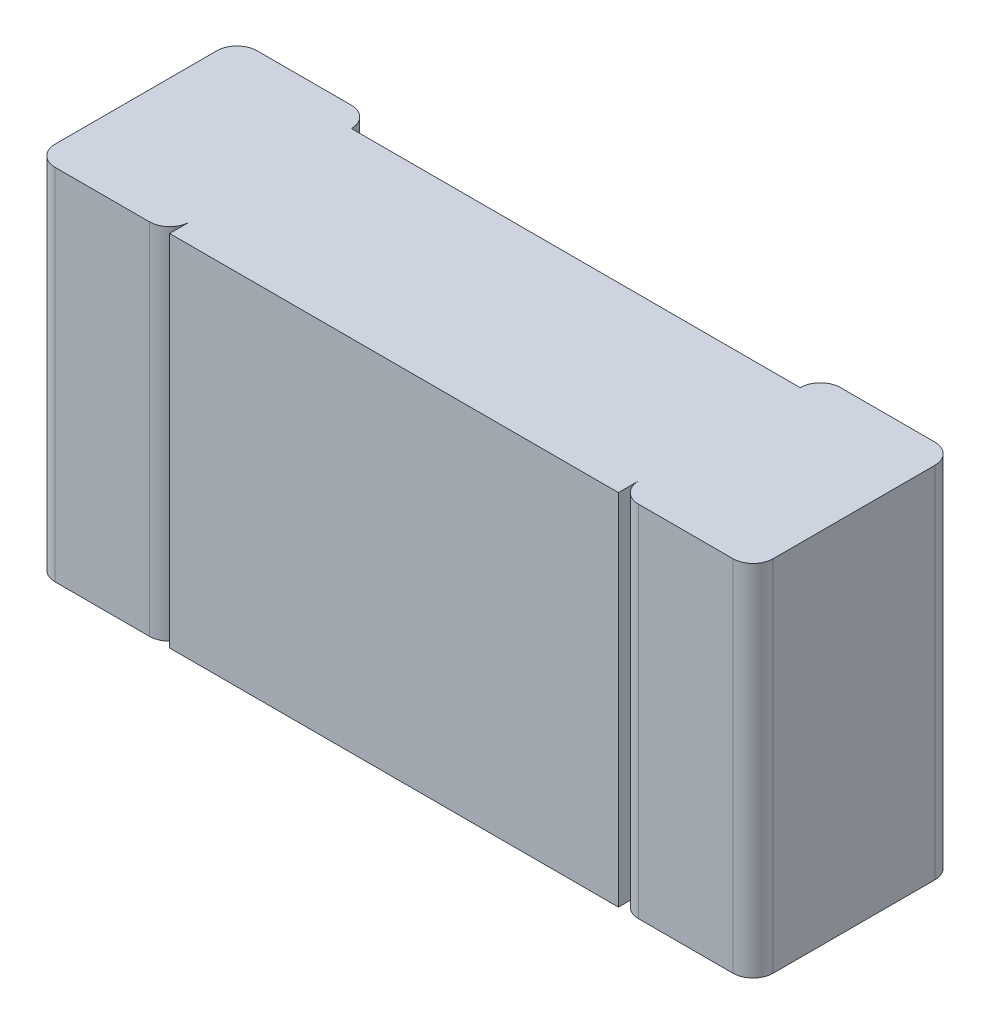
ISO-10303-21;
HEADER;
FILE_DESCRIPTION(('STEP AP214'),'2;1');
FILE_NAME('part.step','',(''),(''),'','','');
FILE_SCHEMA(('AUTOMOTIVE_DESIGN { 1 0 10303 214 1 1 1 1 }'));
ENDSEC;
DATA;
#1=APPLICATION_CONTEXT('core data for automotive mechanical design processes');
#2=APPLICATION_PROTOCOL_DEFINITION('international standard','automotive_design',2000,#1);
#3=PRODUCT_CONTEXT('',#1,'mechanical');
#4=PRODUCT('Part','Part','',(#3));
#5=PRODUCT_RELATED_PRODUCT_CATEGORY('part','',(#4));
#6=PRODUCT_DEFINITION_FORMATION('','',#4);
#7=PRODUCT_DEFINITION_CONTEXT('part definition',#1,'design');
#8=PRODUCT_DEFINITION('design','',#6,#7);
#9=PRODUCT_DEFINITION_SHAPE('','',#8);
#10=(LENGTH_UNIT() NAMED_UNIT(*) SI_UNIT(.MILLI.,.METRE.));
#11=(NAMED_UNIT(*) PLANE_ANGLE_UNIT() SI_UNIT($,.RADIAN.));
#12=(NAMED_UNIT(*) SI_UNIT($,.STERADIAN.) SOLID_ANGLE_UNIT());
#13=UNCERTAINTY_MEASURE_WITH_UNIT(LENGTH_MEASURE(1.E-05),#10,'distance_accuracy_value','');
#14=(GEOMETRIC_REPRESENTATION_CONTEXT(3) GLOBAL_UNCERTAINTY_ASSIGNED_CONTEXT((#13)) GLOBAL_UNIT_ASSIGNED_CONTEXT((#10,
#11,#12)) REPRESENTATION_CONTEXT('',''));
#15=CARTESIAN_POINT('',(0.,0.,0.));
#16=DIRECTION('',(0.,0.,1.));
#17=DIRECTION('',(1.,0.,0.));
#18=AXIS2_PLACEMENT_3D('',#15,#16,#17);
#19=CARTESIAN_POINT('',(-0.5,-0.4,0.45));
#20=DIRECTION('',(0.,0.,1.));
#21=DIRECTION('',(1.,0.,0.));
#22=AXIS2_PLACEMENT_3D('',#19,#20,#21);
#23=PLANE('',#22);
#24=DIRECTION('',(0.,1.,0.));
#25=VECTOR('',#24,1.);
#26=CARTESIAN_POINT('',(-0.5,-0.4,0.45));
#27=LINE('',#26,#25);
#28=CARTESIAN_POINT('',(-0.5,-0.4,0.45));
#29=VERTEX_POINT('',#28);
#30=CARTESIAN_POINT('',(-0.5,0.4,0.45));
#31=VERTEX_POINT('',#30);
#32=EDGE_CURVE('E309',#29,#31,#27,.T.);
#33=ORIENTED_EDGE('',*,*,#32,.F.);
#34=DIRECTION('',(1.,0.,0.));
#35=VECTOR('',#34,1.);
#36=CARTESIAN_POINT('',(-0.5,-0.4,0.45));
#37=LINE('',#36,#35);
#38=CARTESIAN_POINT('',(0.5,-0.4,0.45));
#39=VERTEX_POINT('',#38);
#40=EDGE_CURVE('E302',#29,#39,#37,.T.);
#41=ORIENTED_EDGE('',*,*,#40,.T.);
#42=DIRECTION('',(0.,1.,0.));
#43=VECTOR('',#42,1.);
#44=CARTESIAN_POINT('',(0.5,-0.4,0.45));
#45=LINE('',#44,#43);
#46=CARTESIAN_POINT('',(0.5,0.4,0.45));
#47=VERTEX_POINT('',#46);
#48=EDGE_CURVE('E11',#39,#47,#45,.T.);
#49=ORIENTED_EDGE('',*,*,#48,.T.);
#50=DIRECTION('',(1.,0.,0.));
#51=VECTOR('',#50,1.);
#52=CARTESIAN_POINT('',(-0.5,0.4,0.45));
#53=LINE('',#52,#51);
#54=EDGE_CURVE('E338',#31,#47,#53,.T.);
#55=ORIENTED_EDGE('',*,*,#54,.F.);
#56=EDGE_LOOP('',(#33,#41,#49,#55));
#57=FACE_BOUND('',#56,.T.);
#58=ADVANCED_FACE('F17',(#57),#23,.T.);
#59=CARTESIAN_POINT('',(0.5,-0.4,0.405));
#60=DIRECTION('',(1.,0.,0.));
#61=DIRECTION('',(0.,1.,0.));
#62=AXIS2_PLACEMENT_3D('',#59,#60,#61);
#63=PLANE('',#62);
#64=DIRECTION('',(0.,0.,1.));
#65=VECTOR('',#64,1.);
#66=CARTESIAN_POINT('',(0.5,-0.4,0.405));
#67=LINE('',#66,#65);
#68=CARTESIAN_POINT('',(0.5,-0.4,0.405));
#69=VERTEX_POINT('',#68);
#70=EDGE_CURVE('E298',#69,#39,#67,.T.);
#71=ORIENTED_EDGE('',*,*,#70,.F.);
#72=DIRECTION('',(0.,1.,0.));
#73=VECTOR('',#72,1.);
#74=CARTESIAN_POINT('',(0.5,-0.4,0.405));
#75=LINE('',#74,#73);
#76=CARTESIAN_POINT('',(0.5,0.4,0.405));
#77=VERTEX_POINT('',#76);
#78=EDGE_CURVE('E27',#69,#77,#75,.T.);
#79=ORIENTED_EDGE('',*,*,#78,.T.);
#80=DIRECTION('',(0.,0.,1.));
#81=VECTOR('',#80,1.);
#82=CARTESIAN_POINT('',(0.5,0.4,0.405));
#83=LINE('',#82,#81);
#84=EDGE_CURVE('E344',#77,#47,#83,.T.);
#85=ORIENTED_EDGE('',*,*,#84,.T.);
#86=ORIENTED_EDGE('',*,*,#48,.F.);
#87=EDGE_LOOP('',(#71,#79,#85,#86));
#88=FACE_BOUND('',#87,.T.);
#89=ADVANCED_FACE('F449',(#88),#63,.T.);
#90=CARTESIAN_POINT('',(0.545,-0.4,0.405));
#91=DIRECTION('',(0.,1.,0.));
#92=DIRECTION('',(-1.,0.,0.));
#93=AXIS2_PLACEMENT_3D('',#90,#91,#92);
#94=CYLINDRICAL_SURFACE('',#93,0.045);
#95=CARTESIAN_POINT('',(0.545,-0.4,0.405));
#96=DIRECTION('',(0.,1.,0.));
#97=DIRECTION('',(0.,0.,1.));
#98=AXIS2_PLACEMENT_3D('',#95,#96,#97);
#99=CIRCLE('',#98,0.045);
#100=CARTESIAN_POINT('',(0.545,-0.4,0.45));
#101=VERTEX_POINT('',#100);
#102=EDGE_CURVE('E289',#69,#101,#99,.T.);
#103=ORIENTED_EDGE('',*,*,#102,.T.);
#104=DIRECTION('',(0.,1.,0.));
#105=VECTOR('',#104,1.);
#106=CARTESIAN_POINT('',(0.545,-0.4,0.45));
#107=LINE('',#106,#105);
#108=CARTESIAN_POINT('',(0.545,0.4,0.45));
#109=VERTEX_POINT('',#108);
#110=EDGE_CURVE('E252',#101,#109,#107,.T.);
#111=ORIENTED_EDGE('',*,*,#110,.T.);
#112=CARTESIAN_POINT('',(0.545,0.4,0.405));
#113=DIRECTION('',(0.,1.,0.));
#114=DIRECTION('',(0.,0.,1.));
#115=AXIS2_PLACEMENT_3D('',#112,#113,#114);
#116=CIRCLE('',#115,0.045);
#117=EDGE_CURVE('E319',#77,#109,#116,.T.);
#118=ORIENTED_EDGE('',*,*,#117,.F.);
#119=ORIENTED_EDGE('',*,*,#78,.F.);
#120=EDGE_LOOP('',(#103,#111,#118,#119));
#121=FACE_BOUND('',#120,.T.);
#122=ADVANCED_FACE('F19',(#121),#94,.T.);
#123=CARTESIAN_POINT('',(0.5,-0.4,0.45));
#124=DIRECTION('',(0.,0.,1.));
#125=DIRECTION('',(1.,0.,0.));
#126=AXIS2_PLACEMENT_3D('',#123,#124,#125);
#127=PLANE('',#126);
#128=DIRECTION('',(1.,0.,0.));
#129=VECTOR('',#128,1.);
#130=CARTESIAN_POINT('',(0.5,0.4,0.45));
#131=LINE('',#130,#129);
#132=CARTESIAN_POINT('',(0.755,0.4,0.45));
#133=VERTEX_POINT('',#132);
#134=EDGE_CURVE('E323',#109,#133,#131,.T.);
#135=ORIENTED_EDGE('',*,*,#134,.F.);
#136=ORIENTED_EDGE('',*,*,#110,.F.);
#137=DIRECTION('',(1.,0.,0.));
#138=VECTOR('',#137,1.);
#139=CARTESIAN_POINT('',(0.5,-0.4,0.45));
#140=LINE('',#139,#138);
#141=CARTESIAN_POINT('',(0.755,-0.4,0.45));
#142=VERTEX_POINT('',#141);
#143=EDGE_CURVE('E279',#101,#142,#140,.T.);
#144=ORIENTED_EDGE('',*,*,#143,.T.);
#145=DIRECTION('',(0.,1.,0.));
#146=VECTOR('',#145,1.);
#147=CARTESIAN_POINT('',(0.755,-0.4,0.45));
#148=LINE('',#147,#146);
#149=EDGE_CURVE('E249',#142,#133,#148,.T.);
#150=ORIENTED_EDGE('',*,*,#149,.T.);
#151=EDGE_LOOP('',(#135,#136,#144,#150));
#152=FACE_BOUND('',#151,.T.);
#153=ADVANCED_FACE('F372',(#152),#127,.T.);
#154=CARTESIAN_POINT('',(0.755,-0.4,0.405));
#155=DIRECTION('',(0.,1.,0.));
#156=DIRECTION('',(1.,0.,0.));
#157=AXIS2_PLACEMENT_3D('',#154,#155,#156);
#158=CYLINDRICAL_SURFACE('',#157,0.045);
#159=DIRECTION('',(0.,1.,0.));
#160=VECTOR('',#159,1.);
#161=CARTESIAN_POINT('',(0.8,-0.4,0.405));
#162=LINE('',#161,#160);
#163=CARTESIAN_POINT('',(0.8,-0.4,0.405));
#164=VERTEX_POINT('',#163);
#165=CARTESIAN_POINT('',(0.8,0.4,0.405));
#166=VERTEX_POINT('',#165);
#167=EDGE_CURVE('E21',#164,#166,#162,.T.);
#168=ORIENTED_EDGE('',*,*,#167,.T.);
#169=CARTESIAN_POINT('',(0.755,0.4,0.405));
#170=DIRECTION('',(0.,-1.,0.));
#171=DIRECTION('',(0.,0.,1.));
#172=AXIS2_PLACEMENT_3D('',#169,#170,#171);
#173=CIRCLE('',#172,0.045);
#174=EDGE_CURVE('E327',#166,#133,#173,.T.);
#175=ORIENTED_EDGE('',*,*,#174,.T.);
#176=ORIENTED_EDGE('',*,*,#149,.F.);
#177=CARTESIAN_POINT('',(0.755,-0.4,0.405));
#178=DIRECTION('',(0.,-1.,0.));
#179=DIRECTION('',(0.,0.,1.));
#180=AXIS2_PLACEMENT_3D('',#177,#178,#179);
#181=CIRCLE('',#180,0.045);
#182=EDGE_CURVE('E275',#164,#142,#181,.T.);
#183=ORIENTED_EDGE('',*,*,#182,.F.);
#184=EDGE_LOOP('',(#168,#175,#176,#183));
#185=FACE_BOUND('',#184,.T.);
#186=ADVANCED_FACE('F361',(#185),#158,.T.);
#187=CARTESIAN_POINT('',(0.8,-0.4,0.));
#188=DIRECTION('',(1.,0.,0.));
#189=DIRECTION('',(0.,1.,0.));
#190=AXIS2_PLACEMENT_3D('',#187,#188,#189);
#191=PLANE('',#190);
#192=DIRECTION('',(0.,0.,1.));
#193=VECTOR('',#192,1.);
#194=CARTESIAN_POINT('',(0.8,-0.4,0.));
#195=LINE('',#194,#193);
#196=CARTESIAN_POINT('',(0.8,-0.4,0.045));
#197=VERTEX_POINT('',#196);
#198=EDGE_CURVE('E271',#197,#164,#195,.T.);
#199=ORIENTED_EDGE('',*,*,#198,.F.);
#200=DIRECTION('',(0.,1.,0.));
#201=VECTOR('',#200,1.);
#202=CARTESIAN_POINT('',(0.8,-0.4,0.045));
#203=LINE('',#202,#201);
#204=CARTESIAN_POINT('',(0.8,0.4,0.045));
#205=VERTEX_POINT('',#204);
#206=EDGE_CURVE('E48',#197,#205,#203,.T.);
#207=ORIENTED_EDGE('',*,*,#206,.T.);
#208=DIRECTION('',(0.,0.,1.));
#209=VECTOR('',#208,1.);
#210=CARTESIAN_POINT('',(0.8,0.4,0.));
#211=LINE('',#210,#209);
#212=EDGE_CURVE('E331',#205,#166,#211,.T.);
#213=ORIENTED_EDGE('',*,*,#212,.T.);
#214=ORIENTED_EDGE('',*,*,#167,.F.);
#215=EDGE_LOOP('',(#199,#207,#213,#214));
#216=FACE_BOUND('',#215,.T.);
#217=ADVANCED_FACE('F364',(#216),#191,.T.);
#218=CARTESIAN_POINT('',(0.755,-0.4,0.045));
#219=DIRECTION('',(0.,1.,0.));
#220=DIRECTION('',(1.,0.,0.));
#221=AXIS2_PLACEMENT_3D('',#218,#219,#220);
#222=CYLINDRICAL_SURFACE('',#221,0.045);
#223=CARTESIAN_POINT('',(0.755,-0.4,0.045));
#224=DIRECTION('',(0.,1.,0.));
#225=DIRECTION('',(0.,0.,1.));
#226=AXIS2_PLACEMENT_3D('',#223,#224,#225);
#227=CIRCLE('',#226,0.045);
#228=CARTESIAN_POINT('',(0.755,-0.4,0.));
#229=VERTEX_POINT('',#228);
#230=EDGE_CURVE('E267',#197,#229,#227,.T.);
#231=ORIENTED_EDGE('',*,*,#230,.T.);
#232=DIRECTION('',(0.,1.,0.));
#233=VECTOR('',#232,1.);
#234=CARTESIAN_POINT('',(0.755,-0.4,0.));
#235=LINE('',#234,#233);
#236=CARTESIAN_POINT('',(0.755,0.4,0.));
#237=VERTEX_POINT('',#236);
#238=EDGE_CURVE('E350',#229,#237,#235,.T.);
#239=ORIENTED_EDGE('',*,*,#238,.T.);
#240=CARTESIAN_POINT('',(0.755,0.4,0.045));
#241=DIRECTION('',(0.,1.,0.));
#242=DIRECTION('',(0.,0.,1.));
#243=AXIS2_PLACEMENT_3D('',#240,#241,#242);
#244=CIRCLE('',#243,0.045);
#245=EDGE_CURVE('E334',#205,#237,#244,.T.);
#246=ORIENTED_EDGE('',*,*,#245,.F.);
#247=ORIENTED_EDGE('',*,*,#206,.F.);
#248=EDGE_LOOP('',(#231,#239,#246,#247));
#249=FACE_BOUND('',#248,.T.);
#250=ADVANCED_FACE('F379',(#249),#222,.T.);
#251=CARTESIAN_POINT('',(0.5,-0.4,0.));
#252=DIRECTION('',(0.,0.,1.));
#253=DIRECTION('',(1.,0.,0.));
#254=AXIS2_PLACEMENT_3D('',#251,#252,#253);
#255=PLANE('',#254);
#256=ORIENTED_EDGE('',*,*,#238,.F.);
#257=DIRECTION('',(1.,0.,0.));
#258=VECTOR('',#257,1.);
#259=CARTESIAN_POINT('',(0.5,-0.4,0.));
#260=LINE('',#259,#258);
#261=CARTESIAN_POINT('',(0.545,-0.4,0.));
#262=VERTEX_POINT('',#261);
#263=EDGE_CURVE('E294',#262,#229,#260,.T.);
#264=ORIENTED_EDGE('',*,*,#263,.F.);
#265=DIRECTION('',(0.,1.,0.));
#266=VECTOR('',#265,1.);
#267=CARTESIAN_POINT('',(0.545,-0.4,0.));
#268=LINE('',#267,#266);
#269=CARTESIAN_POINT('',(0.545,0.4,0.));
#270=VERTEX_POINT('',#269);
#271=EDGE_CURVE('E347',#262,#270,#268,.T.);
#272=ORIENTED_EDGE('',*,*,#271,.T.);
#273=DIRECTION('',(1.,0.,0.));
#274=VECTOR('',#273,1.);
#275=CARTESIAN_POINT('',(0.5,0.4,0.));
#276=LINE('',#275,#274);
#277=EDGE_CURVE('E280',#270,#237,#276,.T.);
#278=ORIENTED_EDGE('',*,*,#277,.T.);
#279=EDGE_LOOP('',(#256,#264,#272,#278));
#280=FACE_BOUND('',#279,.T.);
#281=ADVANCED_FACE('F382',(#280),#255,.F.);
#282=CARTESIAN_POINT('',(0.545,-0.4,0.045));
#283=DIRECTION('',(0.,1.,0.));
#284=DIRECTION('',(-1.,0.,0.));
#285=AXIS2_PLACEMENT_3D('',#282,#283,#284);
#286=CYLINDRICAL_SURFACE('',#285,0.045);
#287=DIRECTION('',(0.,1.,0.));
#288=VECTOR('',#287,1.);
#289=CARTESIAN_POINT('',(0.5,-0.4,0.045));
#290=LINE('',#289,#288);
#291=CARTESIAN_POINT('',(0.5,-0.4,0.045));
#292=VERTEX_POINT('',#291);
#293=CARTESIAN_POINT('',(0.5,0.4,0.045));
#294=VERTEX_POINT('',#293);
#295=EDGE_CURVE('E263',#292,#294,#290,.T.);
#296=ORIENTED_EDGE('',*,*,#295,.T.);
#297=CARTESIAN_POINT('',(0.545,0.4,0.045));
#298=DIRECTION('',(0.,-1.,0.));
#299=DIRECTION('',(0.,0.,1.));
#300=AXIS2_PLACEMENT_3D('',#297,#298,#299);
#301=CIRCLE('',#300,0.045);
#302=EDGE_CURVE('E284',#294,#270,#301,.T.);
#303=ORIENTED_EDGE('',*,*,#302,.T.);
#304=ORIENTED_EDGE('',*,*,#271,.F.);
#305=CARTESIAN_POINT('',(0.545,-0.4,0.045));
#306=DIRECTION('',(0.,-1.,0.));
#307=DIRECTION('',(0.,0.,1.));
#308=AXIS2_PLACEMENT_3D('',#305,#306,#307);
#309=CIRCLE('',#308,0.045);
#310=EDGE_CURVE('E290',#292,#262,#309,.T.);
#311=ORIENTED_EDGE('',*,*,#310,.F.);
#312=EDGE_LOOP('',(#296,#303,#304,#311));
#313=FACE_BOUND('',#312,.T.);
#314=ADVANCED_FACE('F384',(#313),#286,.T.);
#315=CARTESIAN_POINT('',(-0.5,-0.4,0.405));
#316=DIRECTION('',(1.,0.,0.));
#317=DIRECTION('',(0.,1.,0.));
#318=AXIS2_PLACEMENT_3D('',#315,#316,#317);
#319=PLANE('',#318);
#320=ORIENTED_EDGE('',*,*,#32,.T.);
#321=DIRECTION('',(0.,0.,1.));
#322=VECTOR('',#321,1.);
#323=CARTESIAN_POINT('',(-0.5,0.4,0.405));
#324=LINE('',#323,#322);
#325=CARTESIAN_POINT('',(-0.5,0.4,0.405));
#326=VERTEX_POINT('',#325);
#327=EDGE_CURVE('E285',#326,#31,#324,.T.);
#328=ORIENTED_EDGE('',*,*,#327,.F.);
#329=DIRECTION('',(0.,1.,0.));
#330=VECTOR('',#329,1.);
#331=CARTESIAN_POINT('',(-0.5,-0.4,0.405));
#332=LINE('',#331,#330);
#333=CARTESIAN_POINT('',(-0.5,-0.4,0.405));
#334=VERTEX_POINT('',#333);
#335=EDGE_CURVE('E255',#334,#326,#332,.T.);
#336=ORIENTED_EDGE('',*,*,#335,.F.);
#337=DIRECTION('',(0.,0.,1.));
#338=VECTOR('',#337,1.);
#339=CARTESIAN_POINT('',(-0.5,-0.4,0.405));
#340=LINE('',#339,#338);
#341=EDGE_CURVE('E305',#334,#29,#340,.T.);
#342=ORIENTED_EDGE('',*,*,#341,.T.);
#343=EDGE_LOOP('',(#320,#328,#336,#342));
#344=FACE_BOUND('',#343,.T.);
#345=ADVANCED_FACE('F475',(#344),#319,.F.);
#346=CARTESIAN_POINT('',(-0.755,-0.4,0.045));
#347=DIRECTION('',(0.,0.,1.));
#348=DIRECTION('',(1.,0.,0.));
#349=AXIS2_PLACEMENT_3D('',#346,#347,#348);
#350=PLANE('',#349);
#351=DIRECTION('',(1.,0.,0.));
#352=VECTOR('',#351,1.);
#353=CARTESIAN_POINT('',(-0.755,0.4,0.045));
#354=LINE('',#353,#352);
#355=CARTESIAN_POINT('',(-0.5,0.4,0.045));
#356=VERTEX_POINT('',#355);
#357=EDGE_CURVE('E259',#356,#294,#354,.T.);
#358=ORIENTED_EDGE('',*,*,#357,.T.);
#359=ORIENTED_EDGE('',*,*,#295,.F.);
#360=DIRECTION('',(1.,0.,0.));
#361=VECTOR('',#360,1.);
#362=CARTESIAN_POINT('',(-0.755,-0.4,0.045));
#363=LINE('',#362,#361);
#364=CARTESIAN_POINT('',(-0.5,-0.4,0.045));
#365=VERTEX_POINT('',#364);
#366=EDGE_CURVE('E244',#365,#292,#363,.T.);
#367=ORIENTED_EDGE('',*,*,#366,.F.);
#368=DIRECTION('',(0.,1.,0.));
#369=VECTOR('',#368,1.);
#370=CARTESIAN_POINT('',(-0.5,-0.4,0.045));
#371=LINE('',#370,#369);
#372=EDGE_CURVE('E239',#365,#356,#371,.T.);
#373=ORIENTED_EDGE('',*,*,#372,.T.);
#374=EDGE_LOOP('',(#358,#359,#367,#373));
#375=FACE_BOUND('',#374,.T.);
#376=ADVANCED_FACE('F389',(#375),#350,.F.);
#377=CARTESIAN_POINT('',(-0.545,-0.4,0.405));
#378=DIRECTION('',(0.,1.,0.));
#379=DIRECTION('',(1.,0.,0.));
#380=AXIS2_PLACEMENT_3D('',#377,#378,#379);
#381=CYLINDRICAL_SURFACE('',#380,0.045);
#382=ORIENTED_EDGE('',*,*,#335,.T.);
#383=CARTESIAN_POINT('',(-0.545,0.4,0.405));
#384=DIRECTION('',(0.,-1.,0.));
#385=DIRECTION('',(0.,0.,1.));
#386=AXIS2_PLACEMENT_3D('',#383,#384,#385);
#387=CIRCLE('',#386,0.045);
#388=CARTESIAN_POINT('',(-0.545,0.4,0.45));
#389=VERTEX_POINT('',#388);
#390=EDGE_CURVE('E229',#326,#389,#387,.T.);
#391=ORIENTED_EDGE('',*,*,#390,.T.);
#392=DIRECTION('',(0.,1.,0.));
#393=VECTOR('',#392,1.);
#394=CARTESIAN_POINT('',(-0.545,-0.4,0.45));
#395=LINE('',#394,#393);
#396=CARTESIAN_POINT('',(-0.545,-0.4,0.45));
#397=VERTEX_POINT('',#396);
#398=EDGE_CURVE('E248',#397,#389,#395,.T.);
#399=ORIENTED_EDGE('',*,*,#398,.F.);
#400=CARTESIAN_POINT('',(-0.545,-0.4,0.405));
#401=DIRECTION('',(0.,-1.,0.));
#402=DIRECTION('',(0.,0.,1.));
#403=AXIS2_PLACEMENT_3D('',#400,#401,#402);
#404=CIRCLE('',#403,0.045);
#405=EDGE_CURVE('E214',#334,#397,#404,.T.);
#406=ORIENTED_EDGE('',*,*,#405,.F.);
#407=EDGE_LOOP('',(#382,#391,#399,#406));
#408=FACE_BOUND('',#407,.T.);
#409=ADVANCED_FACE('F477',(#408),#381,.T.);
#410=CARTESIAN_POINT('',(-0.8,-0.4,0.45));
#411=DIRECTION('',(0.,0.,1.));
#412=DIRECTION('',(1.,0.,0.));
#413=AXIS2_PLACEMENT_3D('',#410,#411,#412);
#414=PLANE('',#413);
#415=DIRECTION('',(1.,0.,0.));
#416=VECTOR('',#415,1.);
#417=CARTESIAN_POINT('',(-0.8,0.4,0.45));
#418=LINE('',#417,#416);
#419=CARTESIAN_POINT('',(-0.755,0.4,0.45));
#420=VERTEX_POINT('',#419);
#421=EDGE_CURVE('E193',#420,#389,#418,.T.);
#422=ORIENTED_EDGE('',*,*,#421,.F.);
#423=DIRECTION('',(0.,1.,0.));
#424=VECTOR('',#423,1.);
#425=CARTESIAN_POINT('',(-0.755,-0.4,0.45));
#426=LINE('',#425,#424);
#427=CARTESIAN_POINT('',(-0.755,-0.4,0.45));
#428=VERTEX_POINT('',#427);
#429=EDGE_CURVE('E186',#428,#420,#426,.T.);
#430=ORIENTED_EDGE('',*,*,#429,.F.);
#431=DIRECTION('',(1.,0.,0.));
#432=VECTOR('',#431,1.);
#433=CARTESIAN_POINT('',(-0.8,-0.4,0.45));
#434=LINE('',#433,#432);
#435=EDGE_CURVE('E190',#428,#397,#434,.T.);
#436=ORIENTED_EDGE('',*,*,#435,.T.);
#437=ORIENTED_EDGE('',*,*,#398,.T.);
#438=EDGE_LOOP('',(#422,#430,#436,#437));
#439=FACE_BOUND('',#438,.T.);
#440=ADVANCED_FACE('F188',(#439),#414,.T.);
#441=CARTESIAN_POINT('',(-0.545,-0.4,0.045));
#442=DIRECTION('',(0.,1.,0.));
#443=DIRECTION('',(1.,0.,0.));
#444=AXIS2_PLACEMENT_3D('',#441,#442,#443);
#445=CYLINDRICAL_SURFACE('',#444,0.045);
#446=CARTESIAN_POINT('',(-0.545,-0.4,0.045));
#447=DIRECTION('',(0.,1.,0.));
#448=DIRECTION('',(0.,0.,1.));
#449=AXIS2_PLACEMENT_3D('',#446,#447,#448);
#450=CIRCLE('',#449,0.045);
#451=CARTESIAN_POINT('',(-0.545,-0.4,0.));
#452=VERTEX_POINT('',#451);
#453=EDGE_CURVE('E220',#365,#452,#450,.T.);
#454=ORIENTED_EDGE('',*,*,#453,.T.);
#455=DIRECTION('',(0.,1.,0.));
#456=VECTOR('',#455,1.);
#457=CARTESIAN_POINT('',(-0.545,-0.4,0.));
#458=LINE('',#457,#456);
#459=CARTESIAN_POINT('',(-0.545,0.4,0.));
#460=VERTEX_POINT('',#459);
#461=EDGE_CURVE('E237',#452,#460,#458,.T.);
#462=ORIENTED_EDGE('',*,*,#461,.T.);
#463=CARTESIAN_POINT('',(-0.545,0.4,0.045));
#464=DIRECTION('',(0.,1.,0.));
#465=DIRECTION('',(0.,0.,1.));
#466=AXIS2_PLACEMENT_3D('',#463,#464,#465);
#467=CIRCLE('',#466,0.045);
#468=EDGE_CURVE('E233',#356,#460,#467,.T.);
#469=ORIENTED_EDGE('',*,*,#468,.F.);
#470=ORIENTED_EDGE('',*,*,#372,.F.);
#471=EDGE_LOOP('',(#454,#462,#469,#470));
#472=FACE_BOUND('',#471,.T.);
#473=ADVANCED_FACE('F392',(#472),#445,.T.);
#474=CARTESIAN_POINT('',(-0.8,-0.4,0.));
#475=DIRECTION('',(0.,0.,1.));
#476=DIRECTION('',(1.,0.,0.));
#477=AXIS2_PLACEMENT_3D('',#474,#475,#476);
#478=PLANE('',#477);
#479=ORIENTED_EDGE('',*,*,#461,.F.);
#480=DIRECTION('',(1.,0.,0.));
#481=VECTOR('',#480,1.);
#482=CARTESIAN_POINT('',(-0.8,-0.4,0.));
#483=LINE('',#482,#481);
#484=CARTESIAN_POINT('',(-0.755,-0.4,0.));
#485=VERTEX_POINT('',#484);
#486=EDGE_CURVE('E398',#485,#452,#483,.T.);
#487=ORIENTED_EDGE('',*,*,#486,.F.);
#488=DIRECTION('',(0.,1.,0.));
#489=VECTOR('',#488,1.);
#490=CARTESIAN_POINT('',(-0.755,-0.4,0.));
#491=LINE('',#490,#489);
#492=CARTESIAN_POINT('',(-0.755,0.4,0.));
#493=VERTEX_POINT('',#492);
#494=EDGE_CURVE('E198',#485,#493,#491,.T.);
#495=ORIENTED_EDGE('',*,*,#494,.T.);
#496=DIRECTION('',(1.,0.,0.));
#497=VECTOR('',#496,1.);
#498=CARTESIAN_POINT('',(-0.8,0.4,0.));
#499=LINE('',#498,#497);
#500=EDGE_CURVE('E225',#493,#460,#499,.T.);
#501=ORIENTED_EDGE('',*,*,#500,.T.);
#502=EDGE_LOOP('',(#479,#487,#495,#501));
#503=FACE_BOUND('',#502,.T.);
#504=ADVANCED_FACE('F396',(#503),#478,.F.);
#505=CARTESIAN_POINT('',(-0.8,0.4,0.));
#506=DIRECTION('',(0.,1.,0.));
#507=DIRECTION('',(1.,0.,0.));
#508=AXIS2_PLACEMENT_3D('',#505,#506,#507);
#509=PLANE('',#508);
#510=ORIENTED_EDGE('',*,*,#390,.F.);
#511=ORIENTED_EDGE('',*,*,#327,.T.);
#512=ORIENTED_EDGE('',*,*,#54,.T.);
#513=ORIENTED_EDGE('',*,*,#84,.F.);
#514=ORIENTED_EDGE('',*,*,#117,.T.);
#515=ORIENTED_EDGE('',*,*,#134,.T.);
#516=ORIENTED_EDGE('',*,*,#174,.F.);
#517=ORIENTED_EDGE('',*,*,#212,.F.);
#518=ORIENTED_EDGE('',*,*,#245,.T.);
#519=ORIENTED_EDGE('',*,*,#277,.F.);
#520=ORIENTED_EDGE('',*,*,#302,.F.);
#521=ORIENTED_EDGE('',*,*,#357,.F.);
#522=ORIENTED_EDGE('',*,*,#468,.T.);
#523=ORIENTED_EDGE('',*,*,#500,.F.);
#524=CARTESIAN_POINT('',(-0.755,0.4,0.045));
#525=DIRECTION('',(0.,-1.,0.));
#526=DIRECTION('',(0.,0.,1.));
#527=AXIS2_PLACEMENT_3D('',#524,#525,#526);
#528=CIRCLE('',#527,0.045);
#529=CARTESIAN_POINT('',(-0.8,0.4,0.045));
#530=VERTEX_POINT('',#529);
#531=EDGE_CURVE('E401',#530,#493,#528,.T.);
#532=ORIENTED_EDGE('',*,*,#531,.F.);
#533=DIRECTION('',(0.,0.,1.));
#534=VECTOR('',#533,1.);
#535=CARTESIAN_POINT('',(-0.8,0.4,0.));
#536=LINE('',#535,#534);
#537=CARTESIAN_POINT('',(-0.8,0.4,0.405));
#538=VERTEX_POINT('',#537);
#539=EDGE_CURVE('E412',#530,#538,#536,.T.);
#540=ORIENTED_EDGE('',*,*,#539,.T.);
#541=CARTESIAN_POINT('',(-0.755,0.4,0.405));
#542=DIRECTION('',(0.,1.,0.));
#543=DIRECTION('',(0.,0.,1.));
#544=AXIS2_PLACEMENT_3D('',#541,#542,#543);
#545=CIRCLE('',#544,0.045);
#546=EDGE_CURVE('E197',#538,#420,#545,.T.);
#547=ORIENTED_EDGE('',*,*,#546,.T.);
#548=ORIENTED_EDGE('',*,*,#421,.T.);
#549=EDGE_LOOP('',(#510,#511,#512,#513,#514,#515,#516,#517,#518,#519,#520,#521,#522,#523,#532,
#540,#547,#548));
#550=FACE_BOUND('',#549,.T.);
#551=ADVANCED_FACE('F367',(#550),#509,.T.);
#552=CARTESIAN_POINT('',(-0.755,-0.4,0.405));
#553=DIRECTION('',(0.,1.,0.));
#554=DIRECTION('',(-1.,0.,0.));
#555=AXIS2_PLACEMENT_3D('',#552,#553,#554);
#556=CYLINDRICAL_SURFACE('',#555,0.045);
#557=CARTESIAN_POINT('',(-0.755,-0.4,0.405));
#558=DIRECTION('',(0.,1.,0.));
#559=DIRECTION('',(0.,0.,1.));
#560=AXIS2_PLACEMENT_3D('',#557,#558,#559);
#561=CIRCLE('',#560,0.045);
#562=CARTESIAN_POINT('',(-0.8,-0.4,0.405));
#563=VERTEX_POINT('',#562);
#564=EDGE_CURVE('E201',#563,#428,#561,.T.);
#565=ORIENTED_EDGE('',*,*,#564,.T.);
#566=ORIENTED_EDGE('',*,*,#429,.T.);
#567=ORIENTED_EDGE('',*,*,#546,.F.);
#568=DIRECTION('',(0.,1.,0.));
#569=VECTOR('',#568,1.);
#570=CARTESIAN_POINT('',(-0.8,-0.4,0.405));
#571=LINE('',#570,#569);
#572=EDGE_CURVE('E204',#563,#538,#571,.T.);
#573=ORIENTED_EDGE('',*,*,#572,.F.);
#574=EDGE_LOOP('',(#565,#566,#567,#573));
#575=FACE_BOUND('',#574,.T.);
#576=ADVANCED_FACE('F202',(#575),#556,.T.);
#577=CARTESIAN_POINT('',(-0.755,-0.4,0.045));
#578=DIRECTION('',(0.,1.,0.));
#579=DIRECTION('',(-1.,0.,0.));
#580=AXIS2_PLACEMENT_3D('',#577,#578,#579);
#581=CYLINDRICAL_SURFACE('',#580,0.045);
#582=DIRECTION('',(0.,1.,0.));
#583=VECTOR('',#582,1.);
#584=CARTESIAN_POINT('',(-0.8,-0.4,0.045));
#585=LINE('',#584,#583);
#586=CARTESIAN_POINT('',(-0.8,-0.4,0.045));
#587=VERTEX_POINT('',#586);
#588=EDGE_CURVE('E419',#587,#530,#585,.T.);
#589=ORIENTED_EDGE('',*,*,#588,.T.);
#590=ORIENTED_EDGE('',*,*,#531,.T.);
#591=ORIENTED_EDGE('',*,*,#494,.F.);
#592=CARTESIAN_POINT('',(-0.755,-0.4,0.045));
#593=DIRECTION('',(0.,-1.,0.));
#594=DIRECTION('',(0.,0.,1.));
#595=AXIS2_PLACEMENT_3D('',#592,#593,#594);
#596=CIRCLE('',#595,0.045);
#597=EDGE_CURVE('E209',#587,#485,#596,.T.);
#598=ORIENTED_EDGE('',*,*,#597,.F.);
#599=EDGE_LOOP('',(#589,#590,#591,#598));
#600=FACE_BOUND('',#599,.T.);
#601=ADVANCED_FACE('F435',(#600),#581,.T.);
#602=CARTESIAN_POINT('',(-0.8,-0.4,0.));
#603=DIRECTION('',(0.,1.,0.));
#604=DIRECTION('',(1.,0.,0.));
#605=AXIS2_PLACEMENT_3D('',#602,#603,#604);
#606=PLANE('',#605);
#607=ORIENTED_EDGE('',*,*,#453,.F.);
#608=ORIENTED_EDGE('',*,*,#366,.T.);
#609=ORIENTED_EDGE('',*,*,#310,.T.);
#610=ORIENTED_EDGE('',*,*,#263,.T.);
#611=ORIENTED_EDGE('',*,*,#230,.F.);
#612=ORIENTED_EDGE('',*,*,#198,.T.);
#613=ORIENTED_EDGE('',*,*,#182,.T.);
#614=ORIENTED_EDGE('',*,*,#143,.F.);
#615=ORIENTED_EDGE('',*,*,#102,.F.);
#616=ORIENTED_EDGE('',*,*,#70,.T.);
#617=ORIENTED_EDGE('',*,*,#40,.F.);
#618=ORIENTED_EDGE('',*,*,#341,.F.);
#619=ORIENTED_EDGE('',*,*,#405,.T.);
#620=ORIENTED_EDGE('',*,*,#435,.F.);
#621=ORIENTED_EDGE('',*,*,#564,.F.);
#622=DIRECTION('',(0.,0.,1.));
#623=VECTOR('',#622,1.);
#624=CARTESIAN_POINT('',(-0.8,-0.4,0.));
#625=LINE('',#624,#623);
#626=EDGE_CURVE('E415',#587,#563,#625,.T.);
#627=ORIENTED_EDGE('',*,*,#626,.F.);
#628=ORIENTED_EDGE('',*,*,#597,.T.);
#629=ORIENTED_EDGE('',*,*,#486,.T.);
#630=EDGE_LOOP('',(#607,#608,#609,#610,#611,#612,#613,#614,#615,#616,#617,#618,#619,#620,#621,
#627,#628,#629));
#631=FACE_BOUND('',#630,.T.);
#632=ADVANCED_FACE('F212',(#631),#606,.F.);
#633=CARTESIAN_POINT('',(-0.8,-0.4,0.));
#634=DIRECTION('',(1.,0.,0.));
#635=DIRECTION('',(0.,1.,0.));
#636=AXIS2_PLACEMENT_3D('',#633,#634,#635);
#637=PLANE('',#636);
#638=ORIENTED_EDGE('',*,*,#572,.T.);
#639=ORIENTED_EDGE('',*,*,#539,.F.);
#640=ORIENTED_EDGE('',*,*,#588,.F.);
#641=ORIENTED_EDGE('',*,*,#626,.T.);
#642=EDGE_LOOP('',(#638,#639,#640,#641));
#643=FACE_BOUND('',#642,.T.);
#644=ADVANCED_FACE('F433',(#643),#637,.F.);
#645=CLOSED_SHELL('',(#58,#89,#122,#153,#186,#217,#250,#281,#314,#345,#376,#409,#440,#473,#504,
#551,#576,#601,#632,#644));
#646=MANIFOLD_SOLID_BREP('B1',#645);
#647=ADVANCED_BREP_SHAPE_REPRESENTATION('',(#18,#646),#14);
#648=SHAPE_DEFINITION_REPRESENTATION(#9,#647);
ENDSEC;
END-ISO-10303-21;
